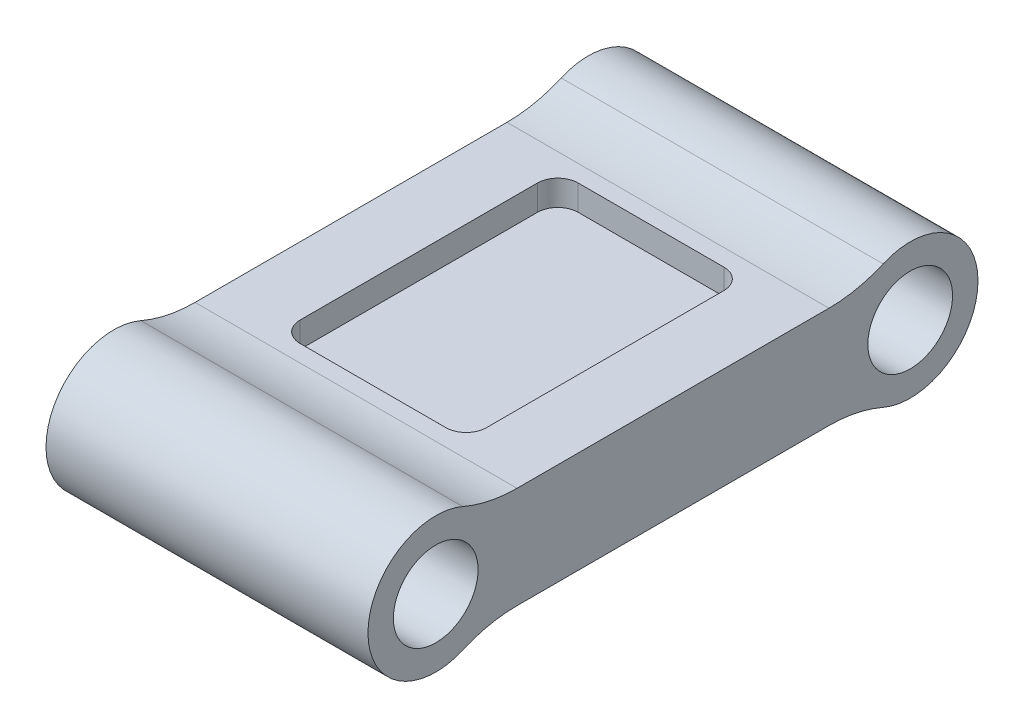
ISO-10303-21;
HEADER;
FILE_DESCRIPTION(('STEP AP214'),'2;1');
FILE_NAME('part.step','',(''),(''),'','','');
FILE_SCHEMA(('AUTOMOTIVE_DESIGN { 1 0 10303 214 1 1 1 1 }'));
ENDSEC;
DATA;
#1=APPLICATION_CONTEXT('core data for automotive mechanical design processes');
#2=APPLICATION_PROTOCOL_DEFINITION('international standard','automotive_design',2000,#1);
#3=PRODUCT_CONTEXT('',#1,'mechanical');
#4=PRODUCT('Part','Part','',(#3));
#5=PRODUCT_RELATED_PRODUCT_CATEGORY('part','',(#4));
#6=PRODUCT_DEFINITION_FORMATION('','',#4);
#7=PRODUCT_DEFINITION_CONTEXT('part definition',#1,'design');
#8=PRODUCT_DEFINITION('design','',#6,#7);
#9=PRODUCT_DEFINITION_SHAPE('','',#8);
#10=(LENGTH_UNIT() NAMED_UNIT(*) SI_UNIT(.MILLI.,.METRE.));
#11=(NAMED_UNIT(*) PLANE_ANGLE_UNIT() SI_UNIT($,.RADIAN.));
#12=(NAMED_UNIT(*) SI_UNIT($,.STERADIAN.) SOLID_ANGLE_UNIT());
#13=UNCERTAINTY_MEASURE_WITH_UNIT(LENGTH_MEASURE(1.E-05),#10,'distance_accuracy_value','');
#14=(GEOMETRIC_REPRESENTATION_CONTEXT(3) GLOBAL_UNCERTAINTY_ASSIGNED_CONTEXT((#13)) GLOBAL_UNIT_ASSIGNED_CONTEXT((#10,
#11,#12)) REPRESENTATION_CONTEXT('',''));
#15=CARTESIAN_POINT('',(0.,0.,0.));
#16=DIRECTION('',(0.,0.,1.));
#17=DIRECTION('',(1.,0.,0.));
#18=AXIS2_PLACEMENT_3D('',#15,#16,#17);
#19=CARTESIAN_POINT('',(127.,-19.05,0.));
#20=DIRECTION('',(0.,1.,0.));
#21=DIRECTION('',(0.,0.,1.));
#22=AXIS2_PLACEMENT_3D('',#19,#20,#21);
#23=PLANE('',#22);
#24=DIRECTION('',(1.,0.,0.));
#25=VECTOR('',#24,1.);
#26=CARTESIAN_POINT('',(127.,-19.05,-147.346469826964));
#27=LINE('',#26,#25);
#28=CARTESIAN_POINT('',(0.,-19.05,-147.346469826964));
#29=VERTEX_POINT('',#28);
#30=CARTESIAN_POINT('',(120.65,-19.05,-147.346469826964));
#31=VERTEX_POINT('',#30);
#32=EDGE_CURVE('E410',#29,#31,#27,.T.);
#33=ORIENTED_EDGE('',*,*,#32,.T.);
#34=DIRECTION('',(0.,0.,1.));
#35=VECTOR('',#34,1.);
#36=CARTESIAN_POINT('',(120.65,-19.05,0.));
#37=LINE('',#36,#35);
#38=CARTESIAN_POINT('',(120.65,-19.05,-30.4535301730358));
#39=VERTEX_POINT('',#38);
#40=EDGE_CURVE('E373',#31,#39,#37,.T.);
#41=ORIENTED_EDGE('',*,*,#40,.T.);
#42=DIRECTION('',(1.,0.,0.));
#43=VECTOR('',#42,1.);
#44=CARTESIAN_POINT('',(0.,-19.05,-30.4535301730358));
#45=LINE('',#44,#43);
#46=CARTESIAN_POINT('',(0.,-19.05,-30.4535301730358));
#47=VERTEX_POINT('',#46);
#48=EDGE_CURVE('E408',#39,#47,#45,.F.);
#49=ORIENTED_EDGE('',*,*,#48,.T.);
#50=DIRECTION('',(0.,0.,-1.));
#51=VECTOR('',#50,1.);
#52=CARTESIAN_POINT('',(0.,-19.05,0.));
#53=LINE('',#52,#51);
#54=EDGE_CURVE('E387',#47,#29,#53,.T.);
#55=ORIENTED_EDGE('',*,*,#54,.T.);
#56=EDGE_LOOP('',(#33,#41,#49,#55));
#57=FACE_BOUND('',#56,.T.);
#58=DIRECTION('',(-1.,0.,0.));
#59=VECTOR('',#58,1.);
#60=CARTESIAN_POINT('',(25.4,-19.05,-140.996469826964));
#61=LINE('',#60,#59);
#62=CARTESIAN_POINT('',(87.63,-19.05,-140.996469826964));
#63=VERTEX_POINT('',#62);
#64=CARTESIAN_POINT('',(33.02,-19.05,-140.996469826964));
#65=VERTEX_POINT('',#64);
#66=EDGE_CURVE('E309',#63,#65,#61,.T.);
#67=ORIENTED_EDGE('',*,*,#66,.T.);
#68=CARTESIAN_POINT('',(33.02,-19.05,-133.376469826964));
#69=DIRECTION('',(0.,1.,0.));
#70=DIRECTION('',(0.,0.,1.));
#71=AXIS2_PLACEMENT_3D('',#68,#69,#70);
#72=CIRCLE('',#71,7.62);
#73=CARTESIAN_POINT('',(25.4,-19.05,-133.376469826964));
#74=VERTEX_POINT('',#73);
#75=EDGE_CURVE('E48',#65,#74,#72,.T.);
#76=ORIENTED_EDGE('',*,*,#75,.T.);
#77=DIRECTION('',(0.,0.,1.));
#78=VECTOR('',#77,1.);
#79=CARTESIAN_POINT('',(25.4,-19.05,-140.996469826964));
#80=LINE('',#79,#78);
#81=CARTESIAN_POINT('',(25.4,-19.05,-44.4235301730358));
#82=VERTEX_POINT('',#81);
#83=EDGE_CURVE('E308',#74,#82,#80,.T.);
#84=ORIENTED_EDGE('',*,*,#83,.T.);
#85=CARTESIAN_POINT('',(33.02,-19.05,-44.4235301730358));
#86=DIRECTION('',(0.,1.,0.));
#87=DIRECTION('',(0.,0.,1.));
#88=AXIS2_PLACEMENT_3D('',#85,#86,#87);
#89=CIRCLE('',#88,7.62);
#90=CARTESIAN_POINT('',(33.02,-19.05,-36.8035301730358));
#91=VERTEX_POINT('',#90);
#92=EDGE_CURVE('E303',#82,#91,#89,.T.);
#93=ORIENTED_EDGE('',*,*,#92,.T.);
#94=DIRECTION('',(1.,0.,0.));
#95=VECTOR('',#94,1.);
#96=CARTESIAN_POINT('',(25.4,-19.05,-36.8035301730358));
#97=LINE('',#96,#95);
#98=CARTESIAN_POINT('',(87.63,-19.05,-36.8035301730358));
#99=VERTEX_POINT('',#98);
#100=EDGE_CURVE('E334',#91,#99,#97,.T.);
#101=ORIENTED_EDGE('',*,*,#100,.T.);
#102=CARTESIAN_POINT('',(87.63,-19.05,-44.4235301730358));
#103=DIRECTION('',(0.,1.,0.));
#104=DIRECTION('',(0.,0.,1.));
#105=AXIS2_PLACEMENT_3D('',#102,#103,#104);
#106=CIRCLE('',#105,7.62);
#107=CARTESIAN_POINT('',(95.25,-19.05,-44.4235301730358));
#108=VERTEX_POINT('',#107);
#109=EDGE_CURVE('E305',#99,#108,#106,.T.);
#110=ORIENTED_EDGE('',*,*,#109,.T.);
#111=DIRECTION('',(0.,0.,-1.));
#112=VECTOR('',#111,1.);
#113=CARTESIAN_POINT('',(95.25,-19.05,-140.996469826964));
#114=LINE('',#113,#112);
#115=CARTESIAN_POINT('',(95.25,-19.05,-133.376469826964));
#116=VERTEX_POINT('',#115);
#117=EDGE_CURVE('E341',#108,#116,#114,.T.);
#118=ORIENTED_EDGE('',*,*,#117,.T.);
#119=CARTESIAN_POINT('',(87.63,-19.05,-133.376469826964));
#120=DIRECTION('',(0.,1.,0.));
#121=DIRECTION('',(0.,0.,1.));
#122=AXIS2_PLACEMENT_3D('',#119,#120,#121);
#123=CIRCLE('',#122,7.62);
#124=EDGE_CURVE('E11',#116,#63,#123,.T.);
#125=ORIENTED_EDGE('',*,*,#124,.T.);
#126=EDGE_LOOP('',(#67,#76,#84,#93,#101,#110,#118,#125));
#127=FACE_BOUND('',#126,.T.);
#128=ADVANCED_FACE('F40',(#57,#127),#23,.F.);
#129=CARTESIAN_POINT('',(127.,0.,-177.8));
#130=DIRECTION('',(-1.,0.,0.));
#131=DIRECTION('',(0.,0.,1.));
#132=AXIS2_PLACEMENT_3D('',#129,#130,#131);
#133=CYLINDRICAL_SURFACE('',#132,25.4);
#134=CARTESIAN_POINT('',(120.65,0.,-177.8));
#135=DIRECTION('',(-1.,0.,0.));
#136=DIRECTION('',(0.,0.,1.));
#137=AXIS2_PLACEMENT_3D('',#134,#135,#136);
#138=CIRCLE('',#137,25.4);
#139=CARTESIAN_POINT('',(120.65,23.2833333333333,-167.648823275655));
#140=VERTEX_POINT('',#139);
#141=CARTESIAN_POINT('',(120.65,-23.2833333333333,-167.648823275655));
#142=VERTEX_POINT('',#141);
#143=EDGE_CURVE('E206',#140,#142,#138,.T.);
#144=ORIENTED_EDGE('',*,*,#143,.T.);
#145=DIRECTION('',(-1.,0.,0.));
#146=VECTOR('',#145,1.);
#147=CARTESIAN_POINT('',(127.,-23.2833333333333,-167.648823275655));
#148=LINE('',#147,#146);
#149=CARTESIAN_POINT('',(0.,-23.2833333333333,-167.648823275655));
#150=VERTEX_POINT('',#149);
#151=EDGE_CURVE('E406',#142,#150,#148,.T.);
#152=ORIENTED_EDGE('',*,*,#151,.T.);
#153=CARTESIAN_POINT('',(0.,0.,-177.8));
#154=DIRECTION('',(1.,0.,0.));
#155=DIRECTION('',(0.,0.,-1.));
#156=AXIS2_PLACEMENT_3D('',#153,#154,#155);
#157=CIRCLE('',#156,25.4);
#158=CARTESIAN_POINT('',(0.,23.2833333333333,-167.648823275655));
#159=VERTEX_POINT('',#158);
#160=EDGE_CURVE('E390',#150,#159,#157,.T.);
#161=ORIENTED_EDGE('',*,*,#160,.T.);
#162=DIRECTION('',(-1.,0.,0.));
#163=VECTOR('',#162,1.);
#164=CARTESIAN_POINT('',(127.,23.2833333333333,-167.648823275655));
#165=LINE('',#164,#163);
#166=EDGE_CURVE('E404',#159,#140,#165,.F.);
#167=ORIENTED_EDGE('',*,*,#166,.T.);
#168=EDGE_LOOP('',(#144,#152,#161,#167));
#169=FACE_BOUND('',#168,.T.);
#170=ADVANCED_FACE('F436',(#169),#133,.T.);
#171=CARTESIAN_POINT('',(127.,19.05,0.));
#172=DIRECTION('',(0.,1.,0.));
#173=DIRECTION('',(0.,0.,1.));
#174=AXIS2_PLACEMENT_3D('',#171,#172,#173);
#175=PLANE('',#174);
#176=DIRECTION('',(0.,0.,1.));
#177=VECTOR('',#176,1.);
#178=CARTESIAN_POINT('',(25.4,19.05,-140.996469826964));
#179=LINE('',#178,#177);
#180=CARTESIAN_POINT('',(25.4,19.05,-133.376469826964));
#181=VERTEX_POINT('',#180);
#182=CARTESIAN_POINT('',(25.4,19.05,-44.4235301730358));
#183=VERTEX_POINT('',#182);
#184=EDGE_CURVE('E338',#181,#183,#179,.T.);
#185=ORIENTED_EDGE('',*,*,#184,.F.);
#186=CARTESIAN_POINT('',(33.02,19.05,-133.376469826964));
#187=DIRECTION('',(0.,1.,0.));
#188=DIRECTION('',(0.,0.,1.));
#189=AXIS2_PLACEMENT_3D('',#186,#187,#188);
#190=CIRCLE('',#189,7.62);
#191=CARTESIAN_POINT('',(33.02,19.05,-140.996469826964));
#192=VERTEX_POINT('',#191);
#193=EDGE_CURVE('E272',#181,#192,#190,.F.);
#194=ORIENTED_EDGE('',*,*,#193,.T.);
#195=DIRECTION('',(-1.,0.,0.));
#196=VECTOR('',#195,1.);
#197=CARTESIAN_POINT('',(25.4,19.05,-140.996469826964));
#198=LINE('',#197,#196);
#199=CARTESIAN_POINT('',(87.63,19.05,-140.996469826964));
#200=VERTEX_POINT('',#199);
#201=EDGE_CURVE('E349',#200,#192,#198,.T.);
#202=ORIENTED_EDGE('',*,*,#201,.F.);
#203=CARTESIAN_POINT('',(87.63,19.05,-133.376469826964));
#204=DIRECTION('',(0.,1.,0.));
#205=DIRECTION('',(0.,0.,1.));
#206=AXIS2_PLACEMENT_3D('',#203,#204,#205);
#207=CIRCLE('',#206,7.62);
#208=CARTESIAN_POINT('',(95.25,19.05,-133.376469826964));
#209=VERTEX_POINT('',#208);
#210=EDGE_CURVE('E274',#200,#209,#207,.F.);
#211=ORIENTED_EDGE('',*,*,#210,.T.);
#212=DIRECTION('',(0.,0.,-1.));
#213=VECTOR('',#212,1.);
#214=CARTESIAN_POINT('',(95.25,19.05,-140.996469826964));
#215=LINE('',#214,#213);
#216=CARTESIAN_POINT('',(95.25,19.05,-44.4235301730358));
#217=VERTEX_POINT('',#216);
#218=EDGE_CURVE('E362',#217,#209,#215,.T.);
#219=ORIENTED_EDGE('',*,*,#218,.F.);
#220=CARTESIAN_POINT('',(87.63,19.05,-44.4235301730358));
#221=DIRECTION('',(0.,1.,0.));
#222=DIRECTION('',(0.,0.,1.));
#223=AXIS2_PLACEMENT_3D('',#220,#221,#222);
#224=CIRCLE('',#223,7.62);
#225=CARTESIAN_POINT('',(87.63,19.05,-36.8035301730358));
#226=VERTEX_POINT('',#225);
#227=EDGE_CURVE('E270',#217,#226,#224,.F.);
#228=ORIENTED_EDGE('',*,*,#227,.T.);
#229=DIRECTION('',(1.,0.,0.));
#230=VECTOR('',#229,1.);
#231=CARTESIAN_POINT('',(25.4,19.05,-36.8035301730358));
#232=LINE('',#231,#230);
#233=CARTESIAN_POINT('',(33.02,19.05,-36.8035301730358));
#234=VERTEX_POINT('',#233);
#235=EDGE_CURVE('E359',#234,#226,#232,.T.);
#236=ORIENTED_EDGE('',*,*,#235,.F.);
#237=CARTESIAN_POINT('',(33.02,19.05,-44.4235301730358));
#238=DIRECTION('',(0.,1.,0.));
#239=DIRECTION('',(0.,0.,1.));
#240=AXIS2_PLACEMENT_3D('',#237,#238,#239);
#241=CIRCLE('',#240,7.62);
#242=EDGE_CURVE('E268',#234,#183,#241,.F.);
#243=ORIENTED_EDGE('',*,*,#242,.T.);
#244=EDGE_LOOP('',(#185,#194,#202,#211,#219,#228,#236,#243));
#245=FACE_BOUND('',#244,.T.);
#246=DIRECTION('',(0.,0.,1.));
#247=VECTOR('',#246,1.);
#248=CARTESIAN_POINT('',(120.65,19.05,0.));
#249=LINE('',#248,#247);
#250=CARTESIAN_POINT('',(120.65,19.05,-147.346469826964));
#251=VERTEX_POINT('',#250);
#252=CARTESIAN_POINT('',(120.65,19.05,-30.4535301730358));
#253=VERTEX_POINT('',#252);
#254=EDGE_CURVE('E203',#251,#253,#249,.T.);
#255=ORIENTED_EDGE('',*,*,#254,.F.);
#256=DIRECTION('',(-1.,0.,0.));
#257=VECTOR('',#256,1.);
#258=CARTESIAN_POINT('',(127.,19.05,-147.346469826964));
#259=LINE('',#258,#257);
#260=CARTESIAN_POINT('',(0.,19.05,-147.346469826964));
#261=VERTEX_POINT('',#260);
#262=EDGE_CURVE('E218',#251,#261,#259,.T.);
#263=ORIENTED_EDGE('',*,*,#262,.T.);
#264=DIRECTION('',(0.,0.,-1.));
#265=VECTOR('',#264,1.);
#266=CARTESIAN_POINT('',(0.,19.05,0.));
#267=LINE('',#266,#265);
#268=CARTESIAN_POINT('',(0.,19.05,-30.4535301730358));
#269=VERTEX_POINT('',#268);
#270=EDGE_CURVE('E393',#269,#261,#267,.T.);
#271=ORIENTED_EDGE('',*,*,#270,.F.);
#272=DIRECTION('',(-1.,0.,0.));
#273=VECTOR('',#272,1.);
#274=CARTESIAN_POINT('',(127.,19.05,-30.4535301730358));
#275=LINE('',#274,#273);
#276=EDGE_CURVE('E221',#269,#253,#275,.F.);
#277=ORIENTED_EDGE('',*,*,#276,.T.);
#278=EDGE_LOOP('',(#255,#263,#271,#277));
#279=FACE_BOUND('',#278,.T.);
#280=ADVANCED_FACE('F216',(#245,#279),#175,.T.);
#281=CARTESIAN_POINT('',(127.,0.,0.));
#282=DIRECTION('',(-1.,0.,0.));
#283=DIRECTION('',(0.,0.,1.));
#284=AXIS2_PLACEMENT_3D('',#281,#282,#283);
#285=CYLINDRICAL_SURFACE('',#284,15.875);
#286=CARTESIAN_POINT('',(120.65,0.,0.));
#287=DIRECTION('',(-1.,0.,0.));
#288=DIRECTION('',(0.,0.,1.));
#289=AXIS2_PLACEMENT_3D('',#286,#287,#288);
#290=CIRCLE('',#289,15.875);
#291=CARTESIAN_POINT('',(120.65,0.,15.875));
#292=VERTEX_POINT('',#291);
#293=EDGE_CURVE('E384',#292,#292,#290,.T.);
#294=ORIENTED_EDGE('',*,*,#293,.F.);
#295=EDGE_LOOP('',(#294));
#296=FACE_BOUND('',#295,.T.);
#297=CARTESIAN_POINT('',(0.,0.,0.));
#298=DIRECTION('',(1.,0.,0.));
#299=DIRECTION('',(0.,0.,-1.));
#300=AXIS2_PLACEMENT_3D('',#297,#298,#299);
#301=CIRCLE('',#300,15.875);
#302=CARTESIAN_POINT('',(0.,0.,-15.875));
#303=VERTEX_POINT('',#302);
#304=EDGE_CURVE('E398',#303,#303,#301,.T.);
#305=ORIENTED_EDGE('',*,*,#304,.F.);
#306=EDGE_LOOP('',(#305));
#307=FACE_BOUND('',#306,.T.);
#308=ADVANCED_FACE('F443',(#296,#307),#285,.F.);
#309=CARTESIAN_POINT('',(127.,0.,0.));
#310=DIRECTION('',(-1.,0.,0.));
#311=DIRECTION('',(0.,0.,1.));
#312=AXIS2_PLACEMENT_3D('',#309,#310,#311);
#313=CYLINDRICAL_SURFACE('',#312,25.4);
#314=CARTESIAN_POINT('',(120.65,0.,0.));
#315=DIRECTION('',(-1.,0.,0.));
#316=DIRECTION('',(0.,0.,1.));
#317=AXIS2_PLACEMENT_3D('',#314,#315,#316);
#318=CIRCLE('',#317,25.4);
#319=CARTESIAN_POINT('',(120.65,-23.2833333333333,-10.1511767243453));
#320=VERTEX_POINT('',#319);
#321=CARTESIAN_POINT('',(120.65,23.2833333333333,-10.1511767243453));
#322=VERTEX_POINT('',#321);
#323=EDGE_CURVE('E371',#320,#322,#318,.T.);
#324=ORIENTED_EDGE('',*,*,#323,.T.);
#325=DIRECTION('',(-1.,0.,0.));
#326=VECTOR('',#325,1.);
#327=CARTESIAN_POINT('',(127.,23.2833333333333,-10.1511767243453));
#328=LINE('',#327,#326);
#329=CARTESIAN_POINT('',(0.,23.2833333333333,-10.1511767243453));
#330=VERTEX_POINT('',#329);
#331=EDGE_CURVE('E231',#322,#330,#328,.T.);
#332=ORIENTED_EDGE('',*,*,#331,.T.);
#333=CARTESIAN_POINT('',(0.,0.,0.));
#334=DIRECTION('',(1.,0.,0.));
#335=DIRECTION('',(0.,0.,-1.));
#336=AXIS2_PLACEMENT_3D('',#333,#334,#335);
#337=CIRCLE('',#336,25.4);
#338=CARTESIAN_POINT('',(0.,-23.2833333333333,-10.1511767243453));
#339=VERTEX_POINT('',#338);
#340=EDGE_CURVE('E395',#330,#339,#337,.T.);
#341=ORIENTED_EDGE('',*,*,#340,.T.);
#342=DIRECTION('',(-1.,0.,0.));
#343=VECTOR('',#342,1.);
#344=CARTESIAN_POINT('',(127.,-23.2833333333333,-10.1511767243453));
#345=LINE('',#344,#343);
#346=EDGE_CURVE('E226',#339,#320,#345,.F.);
#347=ORIENTED_EDGE('',*,*,#346,.T.);
#348=EDGE_LOOP('',(#324,#332,#341,#347));
#349=FACE_BOUND('',#348,.T.);
#350=ADVANCED_FACE('F415',(#349),#313,.T.);
#351=CARTESIAN_POINT('',(127.,0.,-177.8));
#352=DIRECTION('',(-1.,0.,0.));
#353=DIRECTION('',(0.,0.,1.));
#354=AXIS2_PLACEMENT_3D('',#351,#352,#353);
#355=CYLINDRICAL_SURFACE('',#354,15.875);
#356=CARTESIAN_POINT('',(120.65,0.,-177.8));
#357=DIRECTION('',(-1.,0.,0.));
#358=DIRECTION('',(0.,0.,1.));
#359=AXIS2_PLACEMENT_3D('',#356,#357,#358);
#360=CIRCLE('',#359,15.875);
#361=CARTESIAN_POINT('',(120.65,0.,-161.925));
#362=VERTEX_POINT('',#361);
#363=EDGE_CURVE('E381',#362,#362,#360,.T.);
#364=ORIENTED_EDGE('',*,*,#363,.F.);
#365=EDGE_LOOP('',(#364));
#366=FACE_BOUND('',#365,.T.);
#367=CARTESIAN_POINT('',(0.,0.,-177.8));
#368=DIRECTION('',(1.,0.,0.));
#369=DIRECTION('',(0.,0.,-1.));
#370=AXIS2_PLACEMENT_3D('',#367,#368,#369);
#371=CIRCLE('',#370,15.875);
#372=CARTESIAN_POINT('',(0.,0.,-193.675));
#373=VERTEX_POINT('',#372);
#374=EDGE_CURVE('E401',#373,#373,#371,.T.);
#375=ORIENTED_EDGE('',*,*,#374,.F.);
#376=EDGE_LOOP('',(#375));
#377=FACE_BOUND('',#376,.T.);
#378=ADVANCED_FACE('F537',(#366,#377),#355,.F.);
#379=CARTESIAN_POINT('',(0.,0.,0.));
#380=DIRECTION('',(1.,0.,0.));
#381=DIRECTION('',(0.,0.,-1.));
#382=AXIS2_PLACEMENT_3D('',#379,#380,#381);
#383=PLANE('',#382);
#384=ORIENTED_EDGE('',*,*,#54,.F.);
#385=CARTESIAN_POINT('',(0.,-69.85,-30.4535301730358));
#386=DIRECTION('',(1.,0.,0.));
#387=DIRECTION('',(0.,0.,-1.));
#388=AXIS2_PLACEMENT_3D('',#385,#386,#387);
#389=CIRCLE('',#388,50.8);
#390=EDGE_CURVE('E236',#47,#339,#389,.T.);
#391=ORIENTED_EDGE('',*,*,#390,.T.);
#392=ORIENTED_EDGE('',*,*,#340,.F.);
#393=CARTESIAN_POINT('',(0.,69.85,-30.4535301730358));
#394=DIRECTION('',(1.,0.,0.));
#395=DIRECTION('',(0.,0.,-1.));
#396=AXIS2_PLACEMENT_3D('',#393,#394,#395);
#397=CIRCLE('',#396,50.8);
#398=EDGE_CURVE('E238',#330,#269,#397,.T.);
#399=ORIENTED_EDGE('',*,*,#398,.T.);
#400=ORIENTED_EDGE('',*,*,#270,.T.);
#401=CARTESIAN_POINT('',(0.,69.85,-147.346469826964));
#402=DIRECTION('',(1.,0.,0.));
#403=DIRECTION('',(0.,0.,-1.));
#404=AXIS2_PLACEMENT_3D('',#401,#402,#403);
#405=CIRCLE('',#404,50.8);
#406=EDGE_CURVE('E212',#261,#159,#405,.T.);
#407=ORIENTED_EDGE('',*,*,#406,.T.);
#408=ORIENTED_EDGE('',*,*,#160,.F.);
#409=CARTESIAN_POINT('',(0.,-69.85,-147.346469826964));
#410=DIRECTION('',(1.,0.,0.));
#411=DIRECTION('',(0.,0.,-1.));
#412=AXIS2_PLACEMENT_3D('',#409,#410,#411);
#413=CIRCLE('',#412,50.8);
#414=EDGE_CURVE('E228',#150,#29,#413,.T.);
#415=ORIENTED_EDGE('',*,*,#414,.T.);
#416=EDGE_LOOP('',(#384,#391,#392,#399,#400,#407,#408,#415));
#417=FACE_BOUND('',#416,.T.);
#418=ORIENTED_EDGE('',*,*,#304,.T.);
#419=EDGE_LOOP('',(#418));
#420=FACE_BOUND('',#419,.T.);
#421=ORIENTED_EDGE('',*,*,#374,.T.);
#422=EDGE_LOOP('',(#421));
#423=FACE_BOUND('',#422,.T.);
#424=ADVANCED_FACE('F422',(#417,#420,#423),#383,.F.);
#425=CARTESIAN_POINT('',(127.,-69.85,-147.346469826964));
#426=DIRECTION('',(-1.,0.,0.));
#427=DIRECTION('',(0.,0.,1.));
#428=AXIS2_PLACEMENT_3D('',#425,#426,#427);
#429=CYLINDRICAL_SURFACE('',#428,50.8);
#430=ORIENTED_EDGE('',*,*,#151,.F.);
#431=CARTESIAN_POINT('',(120.65,-69.85,-147.346469826964));
#432=DIRECTION('',(-1.,0.,0.));
#433=DIRECTION('',(0.,0.,1.));
#434=AXIS2_PLACEMENT_3D('',#431,#432,#433);
#435=CIRCLE('',#434,50.8);
#436=EDGE_CURVE('E370',#142,#31,#435,.F.);
#437=ORIENTED_EDGE('',*,*,#436,.T.);
#438=ORIENTED_EDGE('',*,*,#32,.F.);
#439=ORIENTED_EDGE('',*,*,#414,.F.);
#440=EDGE_LOOP('',(#430,#437,#438,#439));
#441=FACE_BOUND('',#440,.T.);
#442=ADVANCED_FACE('F433',(#441),#429,.F.);
#443=CARTESIAN_POINT('',(127.,-69.85,-30.4535301730358));
#444=DIRECTION('',(-1.,0.,0.));
#445=DIRECTION('',(0.,0.,1.));
#446=AXIS2_PLACEMENT_3D('',#443,#444,#445);
#447=CYLINDRICAL_SURFACE('',#446,50.8);
#448=ORIENTED_EDGE('',*,*,#48,.F.);
#449=CARTESIAN_POINT('',(120.65,-69.85,-30.4535301730358));
#450=DIRECTION('',(-1.,0.,0.));
#451=DIRECTION('',(0.,0.,1.));
#452=AXIS2_PLACEMENT_3D('',#449,#450,#451);
#453=CIRCLE('',#452,50.8);
#454=EDGE_CURVE('E378',#39,#320,#453,.F.);
#455=ORIENTED_EDGE('',*,*,#454,.T.);
#456=ORIENTED_EDGE('',*,*,#346,.F.);
#457=ORIENTED_EDGE('',*,*,#390,.F.);
#458=EDGE_LOOP('',(#448,#455,#456,#457));
#459=FACE_BOUND('',#458,.T.);
#460=ADVANCED_FACE('F427',(#459),#447,.F.);
#461=CARTESIAN_POINT('',(127.,69.85,-30.4535301730358));
#462=DIRECTION('',(-1.,0.,0.));
#463=DIRECTION('',(0.,0.,1.));
#464=AXIS2_PLACEMENT_3D('',#461,#462,#463);
#465=CYLINDRICAL_SURFACE('',#464,50.8);
#466=ORIENTED_EDGE('',*,*,#331,.F.);
#467=CARTESIAN_POINT('',(120.65,69.85,-30.4535301730358));
#468=DIRECTION('',(-1.,0.,0.));
#469=DIRECTION('',(0.,0.,1.));
#470=AXIS2_PLACEMENT_3D('',#467,#468,#469);
#471=CIRCLE('',#470,50.8);
#472=EDGE_CURVE('E368',#322,#253,#471,.F.);
#473=ORIENTED_EDGE('',*,*,#472,.T.);
#474=ORIENTED_EDGE('',*,*,#276,.F.);
#475=ORIENTED_EDGE('',*,*,#398,.F.);
#476=EDGE_LOOP('',(#466,#473,#474,#475));
#477=FACE_BOUND('',#476,.T.);
#478=ADVANCED_FACE('F419',(#477),#465,.F.);
#479=CARTESIAN_POINT('',(127.,69.85,-147.346469826964));
#480=DIRECTION('',(-1.,0.,0.));
#481=DIRECTION('',(0.,0.,1.));
#482=AXIS2_PLACEMENT_3D('',#479,#480,#481);
#483=CYLINDRICAL_SURFACE('',#482,50.8);
#484=ORIENTED_EDGE('',*,*,#262,.F.);
#485=CARTESIAN_POINT('',(120.65,69.85,-147.346469826964));
#486=DIRECTION('',(-1.,0.,0.));
#487=DIRECTION('',(0.,0.,1.));
#488=AXIS2_PLACEMENT_3D('',#485,#486,#487);
#489=CIRCLE('',#488,50.8);
#490=EDGE_CURVE('E199',#251,#140,#489,.F.);
#491=ORIENTED_EDGE('',*,*,#490,.T.);
#492=ORIENTED_EDGE('',*,*,#166,.F.);
#493=ORIENTED_EDGE('',*,*,#406,.F.);
#494=EDGE_LOOP('',(#484,#491,#492,#493));
#495=FACE_BOUND('',#494,.T.);
#496=ADVANCED_FACE('F224',(#495),#483,.F.);
#497=CARTESIAN_POINT('',(120.65,-25.4,-210.29787344476));
#498=DIRECTION('',(-1.,0.,0.));
#499=DIRECTION('',(0.,0.,1.));
#500=AXIS2_PLACEMENT_3D('',#497,#498,#499);
#501=PLANE('',#500);
#502=ORIENTED_EDGE('',*,*,#293,.T.);
#503=EDGE_LOOP('',(#502));
#504=FACE_BOUND('',#503,.T.);
#505=ORIENTED_EDGE('',*,*,#363,.T.);
#506=EDGE_LOOP('',(#505));
#507=FACE_BOUND('',#506,.T.);
#508=ORIENTED_EDGE('',*,*,#40,.F.);
#509=ORIENTED_EDGE('',*,*,#436,.F.);
#510=ORIENTED_EDGE('',*,*,#143,.F.);
#511=ORIENTED_EDGE('',*,*,#490,.F.);
#512=ORIENTED_EDGE('',*,*,#254,.T.);
#513=ORIENTED_EDGE('',*,*,#472,.F.);
#514=ORIENTED_EDGE('',*,*,#323,.F.);
#515=ORIENTED_EDGE('',*,*,#454,.F.);
#516=EDGE_LOOP('',(#508,#509,#510,#511,#512,#513,#514,#515));
#517=FACE_BOUND('',#516,.T.);
#518=ADVANCED_FACE('F201',(#504,#507,#517),#501,.F.);
#519=CARTESIAN_POINT('',(25.4,9.525,-140.996469826964));
#520=DIRECTION('',(-1.,0.,0.));
#521=DIRECTION('',(0.,0.,1.));
#522=AXIS2_PLACEMENT_3D('',#519,#520,#521);
#523=PLANE('',#522);
#524=ORIENTED_EDGE('',*,*,#184,.T.);
#525=DIRECTION('',(0.,1.,0.));
#526=VECTOR('',#525,1.);
#527=CARTESIAN_POINT('',(25.4,9.525,-44.4235301730358));
#528=LINE('',#527,#526);
#529=CARTESIAN_POINT('',(25.4,9.525,-44.4235301730358));
#530=VERTEX_POINT('',#529);
#531=EDGE_CURVE('E248',#183,#530,#528,.F.);
#532=ORIENTED_EDGE('',*,*,#531,.T.);
#533=DIRECTION('',(0.,0.,1.));
#534=VECTOR('',#533,1.);
#535=CARTESIAN_POINT('',(25.4,9.525,-140.996469826964));
#536=LINE('',#535,#534);
#537=CARTESIAN_POINT('',(25.4,9.525,-133.376469826964));
#538=VERTEX_POINT('',#537);
#539=EDGE_CURVE('E345',#538,#530,#536,.T.);
#540=ORIENTED_EDGE('',*,*,#539,.F.);
#541=DIRECTION('',(0.,1.,0.));
#542=VECTOR('',#541,1.);
#543=CARTESIAN_POINT('',(25.4,19.05,-133.376469826964));
#544=LINE('',#543,#542);
#545=EDGE_CURVE('E245',#538,#181,#544,.T.);
#546=ORIENTED_EDGE('',*,*,#545,.T.);
#547=EDGE_LOOP('',(#524,#532,#540,#546));
#548=FACE_BOUND('',#547,.T.);
#549=ADVANCED_FACE('F521',(#548),#523,.F.);
#550=CARTESIAN_POINT('',(25.4,9.525,-140.996469826964));
#551=DIRECTION('',(0.,0.,-1.));
#552=DIRECTION('',(-1.,0.,0.));
#553=AXIS2_PLACEMENT_3D('',#550,#551,#552);
#554=PLANE('',#553);
#555=ORIENTED_EDGE('',*,*,#201,.T.);
#556=DIRECTION('',(0.,1.,0.));
#557=VECTOR('',#556,1.);
#558=CARTESIAN_POINT('',(33.02,9.525,-140.996469826964));
#559=LINE('',#558,#557);
#560=CARTESIAN_POINT('',(33.02,9.525,-140.996469826964));
#561=VERTEX_POINT('',#560);
#562=EDGE_CURVE('E266',#192,#561,#559,.F.);
#563=ORIENTED_EDGE('',*,*,#562,.T.);
#564=DIRECTION('',(-1.,0.,0.));
#565=VECTOR('',#564,1.);
#566=CARTESIAN_POINT('',(25.4,9.525,-140.996469826964));
#567=LINE('',#566,#565);
#568=CARTESIAN_POINT('',(87.63,9.525,-140.996469826964));
#569=VERTEX_POINT('',#568);
#570=EDGE_CURVE('E222',#569,#561,#567,.T.);
#571=ORIENTED_EDGE('',*,*,#570,.F.);
#572=DIRECTION('',(0.,1.,0.));
#573=VECTOR('',#572,1.);
#574=CARTESIAN_POINT('',(87.63,19.05,-140.996469826964));
#575=LINE('',#574,#573);
#576=EDGE_CURVE('E263',#569,#200,#575,.T.);
#577=ORIENTED_EDGE('',*,*,#576,.T.);
#578=EDGE_LOOP('',(#555,#563,#571,#577));
#579=FACE_BOUND('',#578,.T.);
#580=ADVANCED_FACE('F517',(#579),#554,.F.);
#581=CARTESIAN_POINT('',(95.25,9.525,-140.996469826964));
#582=DIRECTION('',(1.,0.,0.));
#583=DIRECTION('',(0.,0.,-1.));
#584=AXIS2_PLACEMENT_3D('',#581,#582,#583);
#585=PLANE('',#584);
#586=DIRECTION('',(0.,0.,-1.));
#587=VECTOR('',#586,1.);
#588=CARTESIAN_POINT('',(95.25,9.525,-140.996469826964));
#589=LINE('',#588,#587);
#590=CARTESIAN_POINT('',(95.25,9.525,-44.4235301730358));
#591=VERTEX_POINT('',#590);
#592=CARTESIAN_POINT('',(95.25,9.525,-133.376469826964));
#593=VERTEX_POINT('',#592);
#594=EDGE_CURVE('E352',#591,#593,#589,.T.);
#595=ORIENTED_EDGE('',*,*,#594,.F.);
#596=DIRECTION('',(0.,1.,0.));
#597=VECTOR('',#596,1.);
#598=CARTESIAN_POINT('',(95.25,19.05,-44.4235301730358));
#599=LINE('',#598,#597);
#600=EDGE_CURVE('E260',#591,#217,#599,.T.);
#601=ORIENTED_EDGE('',*,*,#600,.T.);
#602=ORIENTED_EDGE('',*,*,#218,.T.);
#603=DIRECTION('',(0.,1.,0.));
#604=VECTOR('',#603,1.);
#605=CARTESIAN_POINT('',(95.25,9.525,-133.376469826964));
#606=LINE('',#605,#604);
#607=EDGE_CURVE('E258',#209,#593,#606,.F.);
#608=ORIENTED_EDGE('',*,*,#607,.T.);
#609=EDGE_LOOP('',(#595,#601,#602,#608));
#610=FACE_BOUND('',#609,.T.);
#611=ADVANCED_FACE('F520',(#610),#585,.F.);
#612=CARTESIAN_POINT('',(25.4,9.525,-36.8035301730358));
#613=DIRECTION('',(0.,0.,1.));
#614=DIRECTION('',(1.,0.,0.));
#615=AXIS2_PLACEMENT_3D('',#612,#613,#614);
#616=PLANE('',#615);
#617=DIRECTION('',(1.,0.,0.));
#618=VECTOR('',#617,1.);
#619=CARTESIAN_POINT('',(25.4,9.525,-36.8035301730358));
#620=LINE('',#619,#618);
#621=CARTESIAN_POINT('',(33.02,9.525,-36.8035301730358));
#622=VERTEX_POINT('',#621);
#623=CARTESIAN_POINT('',(87.63,9.525,-36.8035301730358));
#624=VERTEX_POINT('',#623);
#625=EDGE_CURVE('E348',#622,#624,#620,.T.);
#626=ORIENTED_EDGE('',*,*,#625,.F.);
#627=DIRECTION('',(0.,1.,0.));
#628=VECTOR('',#627,1.);
#629=CARTESIAN_POINT('',(33.02,19.05,-36.8035301730358));
#630=LINE('',#629,#628);
#631=EDGE_CURVE('E242',#622,#234,#630,.T.);
#632=ORIENTED_EDGE('',*,*,#631,.T.);
#633=ORIENTED_EDGE('',*,*,#235,.T.);
#634=DIRECTION('',(0.,1.,0.));
#635=VECTOR('',#634,1.);
#636=CARTESIAN_POINT('',(87.63,9.525,-36.8035301730358));
#637=LINE('',#636,#635);
#638=EDGE_CURVE('E211',#226,#624,#637,.F.);
#639=ORIENTED_EDGE('',*,*,#638,.T.);
#640=EDGE_LOOP('',(#626,#632,#633,#639));
#641=FACE_BOUND('',#640,.T.);
#642=ADVANCED_FACE('F515',(#641),#616,.F.);
#643=CARTESIAN_POINT('',(0.,9.525,0.));
#644=DIRECTION('',(0.,1.,0.));
#645=DIRECTION('',(0.,0.,1.));
#646=AXIS2_PLACEMENT_3D('',#643,#644,#645);
#647=PLANE('',#646);
#648=ORIENTED_EDGE('',*,*,#539,.T.);
#649=CARTESIAN_POINT('',(33.02,9.525,-44.4235301730358));
#650=DIRECTION('',(0.,1.,0.));
#651=DIRECTION('',(0.,0.,1.));
#652=AXIS2_PLACEMENT_3D('',#649,#650,#651);
#653=CIRCLE('',#652,7.62);
#654=EDGE_CURVE('E256',#530,#622,#653,.T.);
#655=ORIENTED_EDGE('',*,*,#654,.T.);
#656=ORIENTED_EDGE('',*,*,#625,.T.);
#657=CARTESIAN_POINT('',(87.63,9.525,-44.4235301730358));
#658=DIRECTION('',(0.,1.,0.));
#659=DIRECTION('',(0.,0.,1.));
#660=AXIS2_PLACEMENT_3D('',#657,#658,#659);
#661=CIRCLE('',#660,7.62);
#662=EDGE_CURVE('E254',#624,#591,#661,.T.);
#663=ORIENTED_EDGE('',*,*,#662,.T.);
#664=ORIENTED_EDGE('',*,*,#594,.T.);
#665=CARTESIAN_POINT('',(87.63,9.525,-133.376469826964));
#666=DIRECTION('',(0.,1.,0.));
#667=DIRECTION('',(0.,0.,1.));
#668=AXIS2_PLACEMENT_3D('',#665,#666,#667);
#669=CIRCLE('',#668,7.62);
#670=EDGE_CURVE('E250',#593,#569,#669,.T.);
#671=ORIENTED_EDGE('',*,*,#670,.T.);
#672=ORIENTED_EDGE('',*,*,#570,.T.);
#673=CARTESIAN_POINT('',(33.02,9.525,-133.376469826964));
#674=DIRECTION('',(0.,1.,0.));
#675=DIRECTION('',(0.,0.,1.));
#676=AXIS2_PLACEMENT_3D('',#673,#674,#675);
#677=CIRCLE('',#676,7.62);
#678=EDGE_CURVE('E252',#561,#538,#677,.T.);
#679=ORIENTED_EDGE('',*,*,#678,.T.);
#680=EDGE_LOOP('',(#648,#655,#656,#663,#664,#671,#672,#679));
#681=FACE_BOUND('',#680,.T.);
#682=ADVANCED_FACE('F461',(#681),#647,.T.);
#683=CARTESIAN_POINT('',(33.02,9.525,-44.4235301730358));
#684=DIRECTION('',(0.,-1.,0.));
#685=DIRECTION('',(0.,0.,-1.));
#686=AXIS2_PLACEMENT_3D('',#683,#684,#685);
#687=CYLINDRICAL_SURFACE('',#686,7.62);
#688=ORIENTED_EDGE('',*,*,#654,.F.);
#689=ORIENTED_EDGE('',*,*,#531,.F.);
#690=ORIENTED_EDGE('',*,*,#242,.F.);
#691=ORIENTED_EDGE('',*,*,#631,.F.);
#692=EDGE_LOOP('',(#688,#689,#690,#691));
#693=FACE_BOUND('',#692,.T.);
#694=ADVANCED_FACE('F457',(#693),#687,.F.);
#695=CARTESIAN_POINT('',(87.63,9.525,-44.4235301730358));
#696=DIRECTION('',(0.,-1.,0.));
#697=DIRECTION('',(0.,0.,-1.));
#698=AXIS2_PLACEMENT_3D('',#695,#696,#697);
#699=CYLINDRICAL_SURFACE('',#698,7.62);
#700=ORIENTED_EDGE('',*,*,#662,.F.);
#701=ORIENTED_EDGE('',*,*,#638,.F.);
#702=ORIENTED_EDGE('',*,*,#227,.F.);
#703=ORIENTED_EDGE('',*,*,#600,.F.);
#704=EDGE_LOOP('',(#700,#701,#702,#703));
#705=FACE_BOUND('',#704,.T.);
#706=ADVANCED_FACE('F460',(#705),#699,.F.);
#707=CARTESIAN_POINT('',(33.02,9.525,-133.376469826964));
#708=DIRECTION('',(0.,-1.,0.));
#709=DIRECTION('',(0.,0.,-1.));
#710=AXIS2_PLACEMENT_3D('',#707,#708,#709);
#711=CYLINDRICAL_SURFACE('',#710,7.62);
#712=ORIENTED_EDGE('',*,*,#678,.F.);
#713=ORIENTED_EDGE('',*,*,#562,.F.);
#714=ORIENTED_EDGE('',*,*,#193,.F.);
#715=ORIENTED_EDGE('',*,*,#545,.F.);
#716=EDGE_LOOP('',(#712,#713,#714,#715));
#717=FACE_BOUND('',#716,.T.);
#718=ADVANCED_FACE('F465',(#717),#711,.F.);
#719=CARTESIAN_POINT('',(87.63,9.525,-133.376469826964));
#720=DIRECTION('',(0.,-1.,0.));
#721=DIRECTION('',(0.,0.,-1.));
#722=AXIS2_PLACEMENT_3D('',#719,#720,#721);
#723=CYLINDRICAL_SURFACE('',#722,7.62);
#724=ORIENTED_EDGE('',*,*,#670,.F.);
#725=ORIENTED_EDGE('',*,*,#607,.F.);
#726=ORIENTED_EDGE('',*,*,#210,.F.);
#727=ORIENTED_EDGE('',*,*,#576,.F.);
#728=EDGE_LOOP('',(#724,#725,#726,#727));
#729=FACE_BOUND('',#728,.T.);
#730=ADVANCED_FACE('F469',(#729),#723,.F.);
#731=CARTESIAN_POINT('',(25.4,-9.525,-140.996469826964));
#732=DIRECTION('',(1.,0.,0.));
#733=DIRECTION('',(0.,0.,-1.));
#734=AXIS2_PLACEMENT_3D('',#731,#732,#733);
#735=PLANE('',#734);
#736=DIRECTION('',(0.,0.,1.));
#737=VECTOR('',#736,1.);
#738=CARTESIAN_POINT('',(25.4,-9.525,-140.996469826964));
#739=LINE('',#738,#737);
#740=CARTESIAN_POINT('',(25.4,-9.525,-133.376469826964));
#741=VERTEX_POINT('',#740);
#742=CARTESIAN_POINT('',(25.4,-9.525,-44.4235301730358));
#743=VERTEX_POINT('',#742);
#744=EDGE_CURVE('E325',#741,#743,#739,.T.);
#745=ORIENTED_EDGE('',*,*,#744,.T.);
#746=DIRECTION('',(0.,-1.,0.));
#747=VECTOR('',#746,1.);
#748=CARTESIAN_POINT('',(25.4,-19.05,-44.4235301730358));
#749=LINE('',#748,#747);
#750=EDGE_CURVE('E278',#743,#82,#749,.T.);
#751=ORIENTED_EDGE('',*,*,#750,.T.);
#752=ORIENTED_EDGE('',*,*,#83,.F.);
#753=DIRECTION('',(0.,-1.,0.));
#754=VECTOR('',#753,1.);
#755=CARTESIAN_POINT('',(25.4,-9.525,-133.376469826964));
#756=LINE('',#755,#754);
#757=EDGE_CURVE('E276',#74,#741,#756,.F.);
#758=ORIENTED_EDGE('',*,*,#757,.T.);
#759=EDGE_LOOP('',(#745,#751,#752,#758));
#760=FACE_BOUND('',#759,.T.);
#761=ADVANCED_FACE('F312',(#760),#735,.T.);
#762=CARTESIAN_POINT('',(25.4,-9.525,-36.8035301730358));
#763=DIRECTION('',(0.,0.,-1.));
#764=DIRECTION('',(-1.,0.,0.));
#765=AXIS2_PLACEMENT_3D('',#762,#763,#764);
#766=PLANE('',#765);
#767=ORIENTED_EDGE('',*,*,#100,.F.);
#768=DIRECTION('',(0.,-1.,0.));
#769=VECTOR('',#768,1.);
#770=CARTESIAN_POINT('',(33.02,-9.525,-36.8035301730358));
#771=LINE('',#770,#769);
#772=CARTESIAN_POINT('',(33.02,-9.525,-36.8035301730358));
#773=VERTEX_POINT('',#772);
#774=EDGE_CURVE('E284',#91,#773,#771,.F.);
#775=ORIENTED_EDGE('',*,*,#774,.T.);
#776=DIRECTION('',(1.,0.,0.));
#777=VECTOR('',#776,1.);
#778=CARTESIAN_POINT('',(25.4,-9.525,-36.8035301730358));
#779=LINE('',#778,#777);
#780=CARTESIAN_POINT('',(87.63,-9.525,-36.8035301730358));
#781=VERTEX_POINT('',#780);
#782=EDGE_CURVE('E332',#773,#781,#779,.T.);
#783=ORIENTED_EDGE('',*,*,#782,.T.);
#784=DIRECTION('',(0.,-1.,0.));
#785=VECTOR('',#784,1.);
#786=CARTESIAN_POINT('',(87.63,-19.05,-36.8035301730358));
#787=LINE('',#786,#785);
#788=EDGE_CURVE('E281',#781,#99,#787,.T.);
#789=ORIENTED_EDGE('',*,*,#788,.T.);
#790=EDGE_LOOP('',(#767,#775,#783,#789));
#791=FACE_BOUND('',#790,.T.);
#792=ADVANCED_FACE('F499',(#791),#766,.T.);
#793=CARTESIAN_POINT('',(95.25,-9.525,-140.996469826964));
#794=DIRECTION('',(-1.,0.,0.));
#795=DIRECTION('',(0.,0.,1.));
#796=AXIS2_PLACEMENT_3D('',#793,#794,#795);
#797=PLANE('',#796);
#798=ORIENTED_EDGE('',*,*,#117,.F.);
#799=DIRECTION('',(0.,-1.,0.));
#800=VECTOR('',#799,1.);
#801=CARTESIAN_POINT('',(95.25,-9.525,-44.4235301730358));
#802=LINE('',#801,#800);
#803=CARTESIAN_POINT('',(95.25,-9.525,-44.4235301730358));
#804=VERTEX_POINT('',#803);
#805=EDGE_CURVE('E297',#108,#804,#802,.F.);
#806=ORIENTED_EDGE('',*,*,#805,.T.);
#807=DIRECTION('',(0.,0.,-1.));
#808=VECTOR('',#807,1.);
#809=CARTESIAN_POINT('',(95.25,-9.525,-140.996469826964));
#810=LINE('',#809,#808);
#811=CARTESIAN_POINT('',(95.25,-9.525,-133.376469826964));
#812=VERTEX_POINT('',#811);
#813=EDGE_CURVE('E329',#804,#812,#810,.T.);
#814=ORIENTED_EDGE('',*,*,#813,.T.);
#815=DIRECTION('',(0.,-1.,0.));
#816=VECTOR('',#815,1.);
#817=CARTESIAN_POINT('',(95.25,-19.05,-133.376469826964));
#818=LINE('',#817,#816);
#819=EDGE_CURVE('E294',#812,#116,#818,.T.);
#820=ORIENTED_EDGE('',*,*,#819,.T.);
#821=EDGE_LOOP('',(#798,#806,#814,#820));
#822=FACE_BOUND('',#821,.T.);
#823=ADVANCED_FACE('F493',(#822),#797,.T.);
#824=CARTESIAN_POINT('',(25.4,-9.525,-140.996469826964));
#825=DIRECTION('',(0.,0.,1.));
#826=DIRECTION('',(1.,0.,0.));
#827=AXIS2_PLACEMENT_3D('',#824,#825,#826);
#828=PLANE('',#827);
#829=DIRECTION('',(-1.,0.,0.));
#830=VECTOR('',#829,1.);
#831=CARTESIAN_POINT('',(25.4,-9.525,-140.996469826964));
#832=LINE('',#831,#830);
#833=CARTESIAN_POINT('',(87.63,-9.525,-140.996469826964));
#834=VERTEX_POINT('',#833);
#835=CARTESIAN_POINT('',(33.02,-9.525,-140.996469826964));
#836=VERTEX_POINT('',#835);
#837=EDGE_CURVE('E323',#834,#836,#832,.T.);
#838=ORIENTED_EDGE('',*,*,#837,.T.);
#839=DIRECTION('',(0.,-1.,0.));
#840=VECTOR('',#839,1.);
#841=CARTESIAN_POINT('',(33.02,-19.05,-140.996469826964));
#842=LINE('',#841,#840);
#843=EDGE_CURVE('E301',#836,#65,#842,.T.);
#844=ORIENTED_EDGE('',*,*,#843,.T.);
#845=ORIENTED_EDGE('',*,*,#66,.F.);
#846=DIRECTION('',(0.,-1.,0.));
#847=VECTOR('',#846,1.);
#848=CARTESIAN_POINT('',(87.63,-9.525,-140.996469826964));
#849=LINE('',#848,#847);
#850=EDGE_CURVE('E299',#63,#834,#849,.F.);
#851=ORIENTED_EDGE('',*,*,#850,.T.);
#852=EDGE_LOOP('',(#838,#844,#845,#851));
#853=FACE_BOUND('',#852,.T.);
#854=ADVANCED_FACE('F327',(#853),#828,.T.);
#855=CARTESIAN_POINT('',(0.,-9.525,0.));
#856=DIRECTION('',(0.,-1.,0.));
#857=DIRECTION('',(0.,0.,1.));
#858=AXIS2_PLACEMENT_3D('',#855,#856,#857);
#859=PLANE('',#858);
#860=ORIENTED_EDGE('',*,*,#782,.F.);
#861=CARTESIAN_POINT('',(33.02,-9.525,-44.4235301730358));
#862=DIRECTION('',(0.,-1.,0.));
#863=DIRECTION('',(0.,0.,-1.));
#864=AXIS2_PLACEMENT_3D('',#861,#862,#863);
#865=CIRCLE('',#864,7.62);
#866=EDGE_CURVE('E292',#773,#743,#865,.T.);
#867=ORIENTED_EDGE('',*,*,#866,.T.);
#868=ORIENTED_EDGE('',*,*,#744,.F.);
#869=CARTESIAN_POINT('',(33.02,-9.525,-133.376469826964));
#870=DIRECTION('',(0.,-1.,0.));
#871=DIRECTION('',(0.,0.,-1.));
#872=AXIS2_PLACEMENT_3D('',#869,#870,#871);
#873=CIRCLE('',#872,7.62);
#874=EDGE_CURVE('E288',#741,#836,#873,.T.);
#875=ORIENTED_EDGE('',*,*,#874,.T.);
#876=ORIENTED_EDGE('',*,*,#837,.F.);
#877=CARTESIAN_POINT('',(87.63,-9.525,-133.376469826964));
#878=DIRECTION('',(0.,-1.,0.));
#879=DIRECTION('',(0.,0.,-1.));
#880=AXIS2_PLACEMENT_3D('',#877,#878,#879);
#881=CIRCLE('',#880,7.62);
#882=EDGE_CURVE('E286',#834,#812,#881,.T.);
#883=ORIENTED_EDGE('',*,*,#882,.T.);
#884=ORIENTED_EDGE('',*,*,#813,.F.);
#885=CARTESIAN_POINT('',(87.63,-9.525,-44.4235301730358));
#886=DIRECTION('',(0.,-1.,0.));
#887=DIRECTION('',(0.,0.,-1.));
#888=AXIS2_PLACEMENT_3D('',#885,#886,#887);
#889=CIRCLE('',#888,7.62);
#890=EDGE_CURVE('E290',#804,#781,#889,.T.);
#891=ORIENTED_EDGE('',*,*,#890,.T.);
#892=EDGE_LOOP('',(#860,#867,#868,#875,#876,#883,#884,#891));
#893=FACE_BOUND('',#892,.T.);
#894=ADVANCED_FACE('F322',(#893),#859,.T.);
#895=CARTESIAN_POINT('',(33.02,-9.525,-44.4235301730358));
#896=DIRECTION('',(0.,1.,0.));
#897=DIRECTION('',(0.,0.,1.));
#898=AXIS2_PLACEMENT_3D('',#895,#896,#897);
#899=CYLINDRICAL_SURFACE('',#898,7.62);
#900=ORIENTED_EDGE('',*,*,#866,.F.);
#901=ORIENTED_EDGE('',*,*,#774,.F.);
#902=ORIENTED_EDGE('',*,*,#92,.F.);
#903=ORIENTED_EDGE('',*,*,#750,.F.);
#904=EDGE_LOOP('',(#900,#901,#902,#903));
#905=FACE_BOUND('',#904,.T.);
#906=ADVANCED_FACE('F474',(#905),#899,.F.);
#907=CARTESIAN_POINT('',(87.63,-9.525,-44.4235301730358));
#908=DIRECTION('',(0.,1.,0.));
#909=DIRECTION('',(0.,0.,1.));
#910=AXIS2_PLACEMENT_3D('',#907,#908,#909);
#911=CYLINDRICAL_SURFACE('',#910,7.62);
#912=ORIENTED_EDGE('',*,*,#890,.F.);
#913=ORIENTED_EDGE('',*,*,#805,.F.);
#914=ORIENTED_EDGE('',*,*,#109,.F.);
#915=ORIENTED_EDGE('',*,*,#788,.F.);
#916=EDGE_LOOP('',(#912,#913,#914,#915));
#917=FACE_BOUND('',#916,.T.);
#918=ADVANCED_FACE('F477',(#917),#911,.F.);
#919=CARTESIAN_POINT('',(33.02,-9.525,-133.376469826964));
#920=DIRECTION('',(0.,1.,0.));
#921=DIRECTION('',(0.,0.,1.));
#922=AXIS2_PLACEMENT_3D('',#919,#920,#921);
#923=CYLINDRICAL_SURFACE('',#922,7.62);
#924=ORIENTED_EDGE('',*,*,#874,.F.);
#925=ORIENTED_EDGE('',*,*,#757,.F.);
#926=ORIENTED_EDGE('',*,*,#75,.F.);
#927=ORIENTED_EDGE('',*,*,#843,.F.);
#928=EDGE_LOOP('',(#924,#925,#926,#927));
#929=FACE_BOUND('',#928,.T.);
#930=ADVANCED_FACE('F317',(#929),#923,.F.);
#931=CARTESIAN_POINT('',(87.63,-9.525,-133.376469826964));
#932=DIRECTION('',(0.,1.,0.));
#933=DIRECTION('',(0.,0.,1.));
#934=AXIS2_PLACEMENT_3D('',#931,#932,#933);
#935=CYLINDRICAL_SURFACE('',#934,7.62);
#936=ORIENTED_EDGE('',*,*,#882,.F.);
#937=ORIENTED_EDGE('',*,*,#850,.F.);
#938=ORIENTED_EDGE('',*,*,#124,.F.);
#939=ORIENTED_EDGE('',*,*,#819,.F.);
#940=EDGE_LOOP('',(#936,#937,#938,#939));
#941=FACE_BOUND('',#940,.T.);
#942=ADVANCED_FACE('F42',(#941),#935,.F.);
#943=CLOSED_SHELL('',(#128,#170,#280,#308,#350,#378,#424,#442,#460,#478,#496,#518,#549,#580,
#611,#642,#682,#694,#706,#718,#730,#761,#792,#823,#854,#894,#906,#918,#930,#942));
#944=MANIFOLD_SOLID_BREP('B2',#943);
#945=ADVANCED_BREP_SHAPE_REPRESENTATION('',(#18,#944),#14);
#946=SHAPE_DEFINITION_REPRESENTATION(#9,#945);
ENDSEC;
END-ISO-10303-21;
